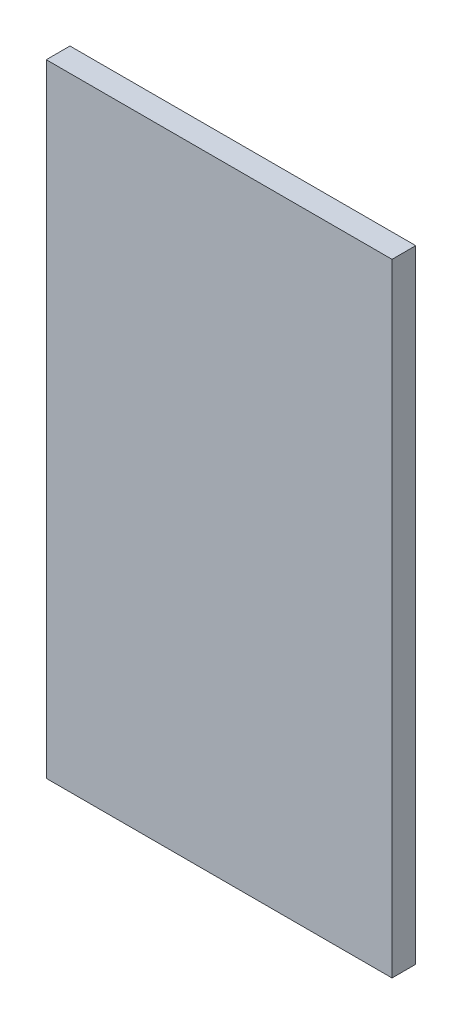
ISO-10303-21;
HEADER;
FILE_DESCRIPTION(('STEP AP214'),'2;1');
FILE_NAME('part.step','',(''),(''),'','','');
FILE_SCHEMA(('AUTOMOTIVE_DESIGN { 1 0 10303 214 1 1 1 1 }'));
ENDSEC;
DATA;
#1=APPLICATION_CONTEXT('core data for automotive mechanical design processes');
#2=APPLICATION_PROTOCOL_DEFINITION('international standard','automotive_design',2000,#1);
#3=PRODUCT_CONTEXT('',#1,'mechanical');
#4=PRODUCT('Part','Part','',(#3));
#5=PRODUCT_RELATED_PRODUCT_CATEGORY('part','',(#4));
#6=PRODUCT_DEFINITION_FORMATION('','',#4);
#7=PRODUCT_DEFINITION_CONTEXT('part definition',#1,'design');
#8=PRODUCT_DEFINITION('design','',#6,#7);
#9=PRODUCT_DEFINITION_SHAPE('','',#8);
#10=(LENGTH_UNIT() NAMED_UNIT(*) SI_UNIT(.MILLI.,.METRE.));
#11=(NAMED_UNIT(*) PLANE_ANGLE_UNIT() SI_UNIT($,.RADIAN.));
#12=(NAMED_UNIT(*) SI_UNIT($,.STERADIAN.) SOLID_ANGLE_UNIT());
#13=UNCERTAINTY_MEASURE_WITH_UNIT(LENGTH_MEASURE(1.E-05),#10,'distance_accuracy_value','');
#14=(GEOMETRIC_REPRESENTATION_CONTEXT(3) GLOBAL_UNCERTAINTY_ASSIGNED_CONTEXT((#13)) GLOBAL_UNIT_ASSIGNED_CONTEXT((#10,
#11,#12)) REPRESENTATION_CONTEXT('',''));
#15=CARTESIAN_POINT('',(0.,0.,0.));
#16=DIRECTION('',(0.,0.,1.));
#17=DIRECTION('',(1.,0.,0.));
#18=AXIS2_PLACEMENT_3D('',#15,#16,#17);
#19=CARTESIAN_POINT('',(11.40008,0.7,0.));
#20=DIRECTION('',(0.,0.,-1.));
#21=DIRECTION('',(-1.,0.,0.));
#22=AXIS2_PLACEMENT_3D('',#19,#20,#21);
#23=PLANE('',#22);
#24=DIRECTION('',(1.,0.,0.));
#25=VECTOR('',#24,1.);
#26=CARTESIAN_POINT('',(11.15008,1.15,0.));
#27=LINE('',#26,#25);
#28=CARTESIAN_POINT('',(11.15008,1.15,0.));
#29=VERTEX_POINT('',#28);
#30=CARTESIAN_POINT('',(11.65008,1.15,0.));
#31=VERTEX_POINT('',#30);
#32=EDGE_CURVE('E55',#29,#31,#27,.T.);
#33=ORIENTED_EDGE('',*,*,#32,.T.);
#34=DIRECTION('',(0.,1.,0.));
#35=VECTOR('',#34,1.);
#36=CARTESIAN_POINT('',(11.65008,1.15,0.));
#37=LINE('',#36,#35);
#38=CARTESIAN_POINT('',(11.65008,0.25,0.));
#39=VERTEX_POINT('',#38);
#40=EDGE_CURVE('E57',#31,#39,#37,.F.);
#41=ORIENTED_EDGE('',*,*,#40,.T.);
#42=DIRECTION('',(1.,0.,0.));
#43=VECTOR('',#42,1.);
#44=CARTESIAN_POINT('',(11.65008,0.25,0.));
#45=LINE('',#44,#43);
#46=CARTESIAN_POINT('',(11.15008,0.25,0.));
#47=VERTEX_POINT('',#46);
#48=EDGE_CURVE('E20',#39,#47,#45,.F.);
#49=ORIENTED_EDGE('',*,*,#48,.T.);
#50=DIRECTION('',(0.,1.,0.));
#51=VECTOR('',#50,1.);
#52=CARTESIAN_POINT('',(11.15008,0.25,0.));
#53=LINE('',#52,#51);
#54=EDGE_CURVE('E80',#47,#29,#53,.T.);
#55=ORIENTED_EDGE('',*,*,#54,.T.);
#56=EDGE_LOOP('',(#33,#41,#49,#55));
#57=FACE_BOUND('',#56,.T.);
#58=ADVANCED_FACE('F17',(#57),#23,.T.);
#59=CARTESIAN_POINT('',(11.65008,0.25,0.));
#60=DIRECTION('',(0.,1.,0.));
#61=DIRECTION('',(0.,0.,1.));
#62=AXIS2_PLACEMENT_3D('',#59,#60,#61);
#63=PLANE('',#62);
#64=DIRECTION('',(0.,0.,-1.));
#65=VECTOR('',#64,1.);
#66=CARTESIAN_POINT('',(11.15008,0.25,0.));
#67=LINE('',#66,#65);
#68=CARTESIAN_POINT('',(11.15008,0.25,0.03429));
#69=VERTEX_POINT('',#68);
#70=EDGE_CURVE('E68',#69,#47,#67,.T.);
#71=ORIENTED_EDGE('',*,*,#70,.T.);
#72=ORIENTED_EDGE('',*,*,#48,.F.);
#73=DIRECTION('',(0.,0.,1.));
#74=VECTOR('',#73,1.);
#75=CARTESIAN_POINT('',(11.65008,0.25,0.));
#76=LINE('',#75,#74);
#77=CARTESIAN_POINT('',(11.65008,0.25,0.03429));
#78=VERTEX_POINT('',#77);
#79=EDGE_CURVE('E63',#39,#78,#76,.T.);
#80=ORIENTED_EDGE('',*,*,#79,.T.);
#81=DIRECTION('',(1.,0.,0.));
#82=VECTOR('',#81,1.);
#83=CARTESIAN_POINT('',(11.40008,0.25,0.03429));
#84=LINE('',#83,#82);
#85=EDGE_CURVE('E83',#69,#78,#84,.T.);
#86=ORIENTED_EDGE('',*,*,#85,.F.);
#87=EDGE_LOOP('',(#71,#72,#80,#86));
#88=FACE_BOUND('',#87,.T.);
#89=ADVANCED_FACE('F65',(#88),#63,.F.);
#90=CARTESIAN_POINT('',(11.65008,1.15,0.));
#91=DIRECTION('',(-1.,0.,0.));
#92=DIRECTION('',(0.,0.,1.));
#93=AXIS2_PLACEMENT_3D('',#90,#91,#92);
#94=PLANE('',#93);
#95=ORIENTED_EDGE('',*,*,#79,.F.);
#96=ORIENTED_EDGE('',*,*,#40,.F.);
#97=DIRECTION('',(0.,0.,-1.));
#98=VECTOR('',#97,1.);
#99=CARTESIAN_POINT('',(11.65008,1.15,0.));
#100=LINE('',#99,#98);
#101=CARTESIAN_POINT('',(11.65008,1.15,0.03429));
#102=VERTEX_POINT('',#101);
#103=EDGE_CURVE('E75',#31,#102,#100,.F.);
#104=ORIENTED_EDGE('',*,*,#103,.T.);
#105=DIRECTION('',(0.,1.,0.));
#106=VECTOR('',#105,1.);
#107=CARTESIAN_POINT('',(11.65008,0.7,0.03429));
#108=LINE('',#107,#106);
#109=EDGE_CURVE('E72',#78,#102,#108,.T.);
#110=ORIENTED_EDGE('',*,*,#109,.F.);
#111=EDGE_LOOP('',(#95,#96,#104,#110));
#112=FACE_BOUND('',#111,.T.);
#113=ADVANCED_FACE('F70',(#112),#94,.F.);
#114=CARTESIAN_POINT('',(11.15008,1.15,0.));
#115=DIRECTION('',(0.,-1.,0.));
#116=DIRECTION('',(0.,0.,-1.));
#117=AXIS2_PLACEMENT_3D('',#114,#115,#116);
#118=PLANE('',#117);
#119=ORIENTED_EDGE('',*,*,#103,.F.);
#120=ORIENTED_EDGE('',*,*,#32,.F.);
#121=DIRECTION('',(0.,0.,-1.));
#122=VECTOR('',#121,1.);
#123=CARTESIAN_POINT('',(11.15008,1.15,0.));
#124=LINE('',#123,#122);
#125=CARTESIAN_POINT('',(11.15008,1.15,0.03429));
#126=VERTEX_POINT('',#125);
#127=EDGE_CURVE('E35',#29,#126,#124,.F.);
#128=ORIENTED_EDGE('',*,*,#127,.T.);
#129=DIRECTION('',(1.,0.,0.));
#130=VECTOR('',#129,1.);
#131=CARTESIAN_POINT('',(11.40008,1.15,0.03429));
#132=LINE('',#131,#130);
#133=EDGE_CURVE('E26',#102,#126,#132,.F.);
#134=ORIENTED_EDGE('',*,*,#133,.F.);
#135=EDGE_LOOP('',(#119,#120,#128,#134));
#136=FACE_BOUND('',#135,.T.);
#137=ADVANCED_FACE('F89',(#136),#118,.F.);
#138=CARTESIAN_POINT('',(11.15008,0.25,0.));
#139=DIRECTION('',(1.,0.,0.));
#140=DIRECTION('',(0.,0.,-1.));
#141=AXIS2_PLACEMENT_3D('',#138,#139,#140);
#142=PLANE('',#141);
#143=ORIENTED_EDGE('',*,*,#127,.F.);
#144=ORIENTED_EDGE('',*,*,#54,.F.);
#145=ORIENTED_EDGE('',*,*,#70,.F.);
#146=DIRECTION('',(0.,1.,0.));
#147=VECTOR('',#146,1.);
#148=CARTESIAN_POINT('',(11.15008,0.7,0.03429));
#149=LINE('',#148,#147);
#150=EDGE_CURVE('E11',#126,#69,#149,.F.);
#151=ORIENTED_EDGE('',*,*,#150,.F.);
#152=EDGE_LOOP('',(#143,#144,#145,#151));
#153=FACE_BOUND('',#152,.T.);
#154=ADVANCED_FACE('F91',(#153),#142,.F.);
#155=CARTESIAN_POINT('',(11.40008,0.7,0.03429));
#156=DIRECTION('',(0.,0.,1.));
#157=DIRECTION('',(1.,0.,0.));
#158=AXIS2_PLACEMENT_3D('',#155,#156,#157);
#159=PLANE('',#158);
#160=ORIENTED_EDGE('',*,*,#133,.T.);
#161=ORIENTED_EDGE('',*,*,#150,.T.);
#162=ORIENTED_EDGE('',*,*,#85,.T.);
#163=ORIENTED_EDGE('',*,*,#109,.T.);
#164=EDGE_LOOP('',(#160,#161,#162,#163));
#165=FACE_BOUND('',#164,.T.);
#166=ADVANCED_FACE('F88',(#165),#159,.T.);
#167=CLOSED_SHELL('',(#58,#89,#113,#137,#154,#166));
#168=MANIFOLD_SOLID_BREP('B1',#167);
#169=ADVANCED_BREP_SHAPE_REPRESENTATION('',(#18,#168),#14);
#170=SHAPE_DEFINITION_REPRESENTATION(#9,#169);
ENDSEC;
END-ISO-10303-21;
